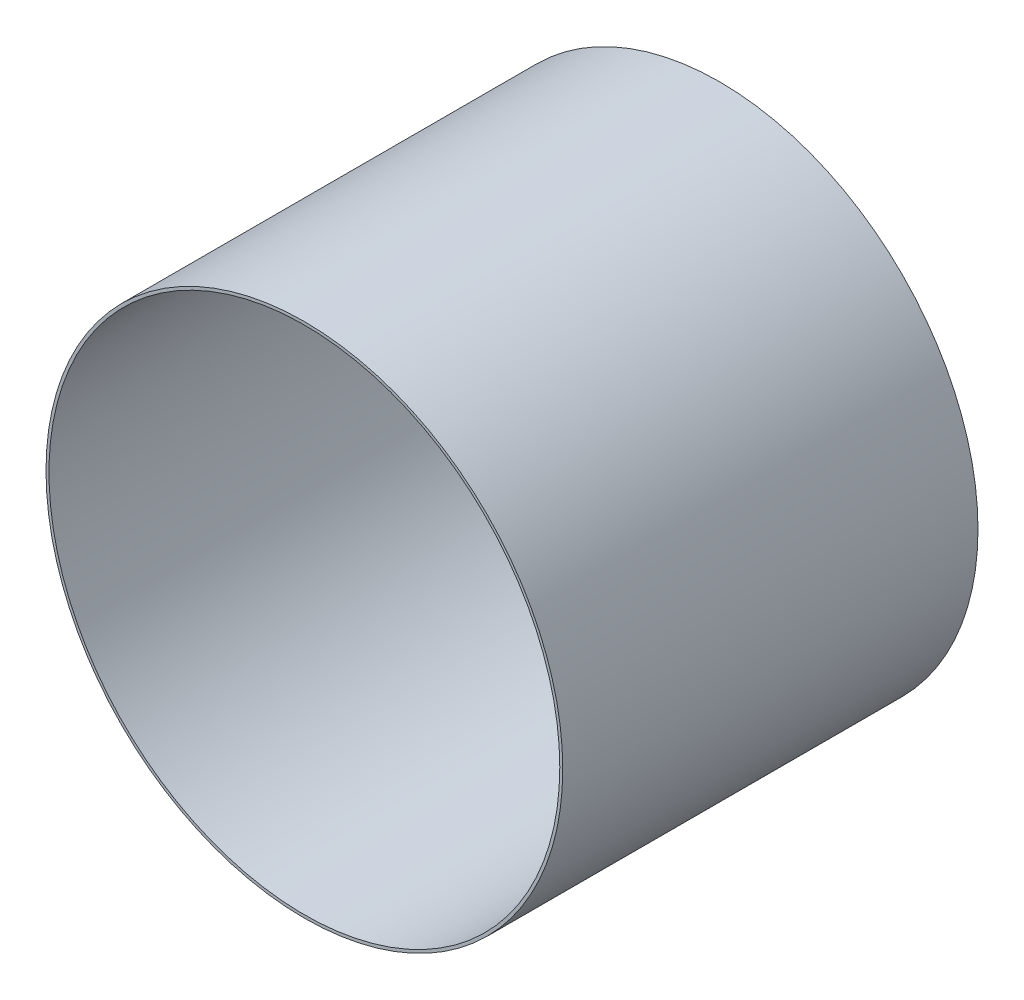
ISO-10303-21;
HEADER;
FILE_DESCRIPTION(('STEP AP214'),'2;1');
FILE_NAME('part.step','',(''),(''),'','','');
FILE_SCHEMA(('AUTOMOTIVE_DESIGN { 1 0 10303 214 1 1 1 1 }'));
ENDSEC;
DATA;
#1=APPLICATION_CONTEXT('core data for automotive mechanical design processes');
#2=APPLICATION_PROTOCOL_DEFINITION('international standard','automotive_design',2000,#1);
#3=PRODUCT_CONTEXT('',#1,'mechanical');
#4=PRODUCT('Part','Part','',(#3));
#5=PRODUCT_RELATED_PRODUCT_CATEGORY('part','',(#4));
#6=PRODUCT_DEFINITION_FORMATION('','',#4);
#7=PRODUCT_DEFINITION_CONTEXT('part definition',#1,'design');
#8=PRODUCT_DEFINITION('design','',#6,#7);
#9=PRODUCT_DEFINITION_SHAPE('','',#8);
#10=(LENGTH_UNIT() NAMED_UNIT(*) SI_UNIT(.MILLI.,.METRE.));
#11=(NAMED_UNIT(*) PLANE_ANGLE_UNIT() SI_UNIT($,.RADIAN.));
#12=(NAMED_UNIT(*) SI_UNIT($,.STERADIAN.) SOLID_ANGLE_UNIT());
#13=UNCERTAINTY_MEASURE_WITH_UNIT(LENGTH_MEASURE(1.E-05),#10,'distance_accuracy_value','');
#14=(GEOMETRIC_REPRESENTATION_CONTEXT(3) GLOBAL_UNCERTAINTY_ASSIGNED_CONTEXT((#13)) GLOBAL_UNIT_ASSIGNED_CONTEXT((#10,
#11,#12)) REPRESENTATION_CONTEXT('',''));
#15=CARTESIAN_POINT('',(0.,0.,0.));
#16=DIRECTION('',(0.,0.,1.));
#17=DIRECTION('',(1.,0.,0.));
#18=AXIS2_PLACEMENT_3D('',#15,#16,#17);
#19=CARTESIAN_POINT('',(0.,0.,140.));
#20=DIRECTION('',(0.,0.,1.));
#21=DIRECTION('',(1.,0.,0.));
#22=AXIS2_PLACEMENT_3D('',#19,#20,#21);
#23=PLANE('',#22);
#24=CARTESIAN_POINT('',(0.,0.,140.));
#25=DIRECTION('',(0.,0.,1.));
#26=DIRECTION('',(1.,0.,0.));
#27=AXIS2_PLACEMENT_3D('',#24,#25,#26);
#28=CIRCLE('',#27,87.110994186458);
#29=CARTESIAN_POINT('',(87.110994186458,0.,140.));
#30=VERTEX_POINT('',#29);
#31=EDGE_CURVE('E10',#30,#30,#28,.T.);
#32=ORIENTED_EDGE('',*,*,#31,.T.);
#33=EDGE_LOOP('',(#32));
#34=FACE_BOUND('',#33,.T.);
#35=CARTESIAN_POINT('',(0.,0.,140.));
#36=DIRECTION('',(0.,0.,1.));
#37=DIRECTION('',(1.,0.,0.));
#38=AXIS2_PLACEMENT_3D('',#35,#36,#37);
#39=CIRCLE('',#38,86.110994186458);
#40=CARTESIAN_POINT('',(86.110994186458,0.,140.));
#41=VERTEX_POINT('',#40);
#42=EDGE_CURVE('E45',#41,#41,#39,.T.);
#43=ORIENTED_EDGE('',*,*,#42,.F.);
#44=EDGE_LOOP('',(#43));
#45=FACE_BOUND('',#44,.T.);
#46=ADVANCED_FACE('F34',(#34,#45),#23,.T.);
#47=CARTESIAN_POINT('',(0.,0.,0.));
#48=DIRECTION('',(0.,0.,1.));
#49=DIRECTION('',(1.,0.,0.));
#50=AXIS2_PLACEMENT_3D('',#47,#48,#49);
#51=PLANE('',#50);
#52=CARTESIAN_POINT('',(0.,0.,0.));
#53=DIRECTION('',(0.,0.,1.));
#54=DIRECTION('',(1.,0.,0.));
#55=AXIS2_PLACEMENT_3D('',#52,#53,#54);
#56=CIRCLE('',#55,87.110994186458);
#57=CARTESIAN_POINT('',(87.110994186458,0.,0.));
#58=VERTEX_POINT('',#57);
#59=EDGE_CURVE('E38',#58,#58,#56,.T.);
#60=ORIENTED_EDGE('',*,*,#59,.F.);
#61=EDGE_LOOP('',(#60));
#62=FACE_BOUND('',#61,.T.);
#63=CARTESIAN_POINT('',(0.,0.,0.));
#64=DIRECTION('',(0.,0.,1.));
#65=DIRECTION('',(1.,0.,0.));
#66=AXIS2_PLACEMENT_3D('',#63,#64,#65);
#67=CIRCLE('',#66,86.110994186458);
#68=CARTESIAN_POINT('',(86.110994186458,0.,0.));
#69=VERTEX_POINT('',#68);
#70=EDGE_CURVE('E47',#69,#69,#67,.T.);
#71=ORIENTED_EDGE('',*,*,#70,.T.);
#72=EDGE_LOOP('',(#71));
#73=FACE_BOUND('',#72,.T.);
#74=ADVANCED_FACE('F57',(#62,#73),#51,.F.);
#75=CARTESIAN_POINT('',(0.,0.,140.));
#76=DIRECTION('',(0.,0.,-1.));
#77=DIRECTION('',(-1.,0.,0.));
#78=AXIS2_PLACEMENT_3D('',#75,#76,#77);
#79=CYLINDRICAL_SURFACE('',#78,87.110994186458);
#80=ORIENTED_EDGE('',*,*,#31,.F.);
#81=EDGE_LOOP('',(#80));
#82=FACE_BOUND('',#81,.T.);
#83=ORIENTED_EDGE('',*,*,#59,.T.);
#84=EDGE_LOOP('',(#83));
#85=FACE_BOUND('',#84,.T.);
#86=ADVANCED_FACE('F36',(#82,#85),#79,.T.);
#87=CARTESIAN_POINT('',(0.,0.,140.));
#88=DIRECTION('',(0.,0.,-1.));
#89=DIRECTION('',(-1.,0.,0.));
#90=AXIS2_PLACEMENT_3D('',#87,#88,#89);
#91=CYLINDRICAL_SURFACE('',#90,86.110994186458);
#92=ORIENTED_EDGE('',*,*,#42,.T.);
#93=EDGE_LOOP('',(#92));
#94=FACE_BOUND('',#93,.T.);
#95=ORIENTED_EDGE('',*,*,#70,.F.);
#96=EDGE_LOOP('',(#95));
#97=FACE_BOUND('',#96,.T.);
#98=ADVANCED_FACE('F53',(#94,#97),#91,.F.);
#99=CLOSED_SHELL('',(#46,#74,#86,#98));
#100=MANIFOLD_SOLID_BREP('B2',#99);
#101=ADVANCED_BREP_SHAPE_REPRESENTATION('',(#18,#100),#14);
#102=SHAPE_DEFINITION_REPRESENTATION(#9,#101);
ENDSEC;
END-ISO-10303-21;
